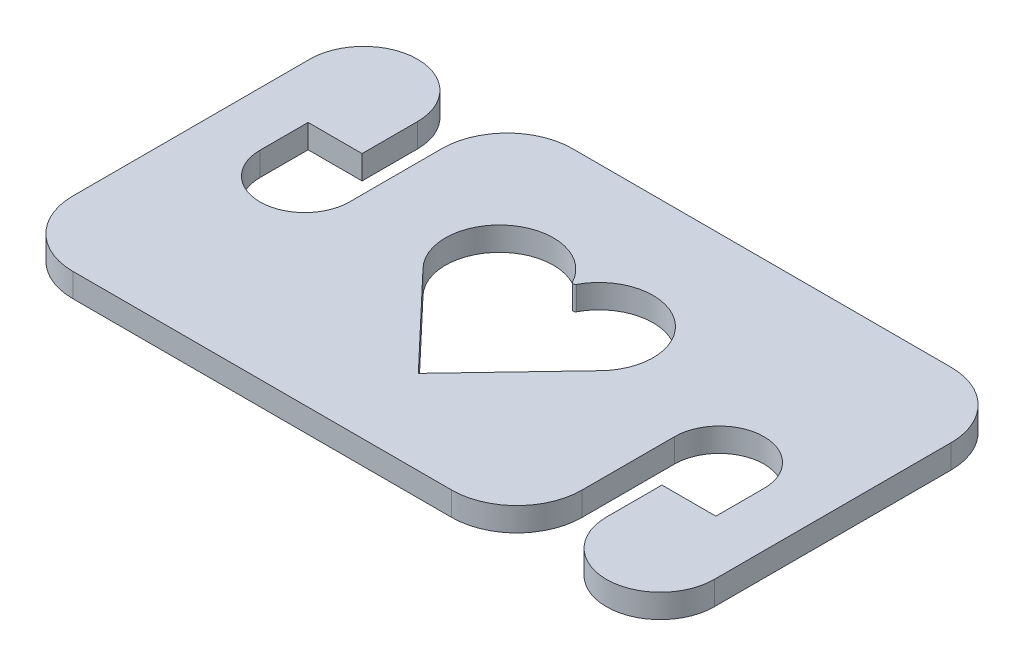
ISO-10303-21;
HEADER;
FILE_DESCRIPTION(('STEP AP214'),'2;1');
FILE_NAME('part.step','',(''),(''),'','','');
FILE_SCHEMA(('AUTOMOTIVE_DESIGN { 1 0 10303 214 1 1 1 1 }'));
ENDSEC;
DATA;
#1=APPLICATION_CONTEXT('core data for automotive mechanical design processes');
#2=APPLICATION_PROTOCOL_DEFINITION('international standard','automotive_design',2000,#1);
#3=PRODUCT_CONTEXT('',#1,'mechanical');
#4=PRODUCT('Part','Part','',(#3));
#5=PRODUCT_RELATED_PRODUCT_CATEGORY('part','',(#4));
#6=PRODUCT_DEFINITION_FORMATION('','',#4);
#7=PRODUCT_DEFINITION_CONTEXT('part definition',#1,'design');
#8=PRODUCT_DEFINITION('design','',#6,#7);
#9=PRODUCT_DEFINITION_SHAPE('','',#8);
#10=(LENGTH_UNIT() NAMED_UNIT(*) SI_UNIT(.MILLI.,.METRE.));
#11=(NAMED_UNIT(*) PLANE_ANGLE_UNIT() SI_UNIT($,.RADIAN.));
#12=(NAMED_UNIT(*) SI_UNIT($,.STERADIAN.) SOLID_ANGLE_UNIT());
#13=UNCERTAINTY_MEASURE_WITH_UNIT(LENGTH_MEASURE(1.E-05),#10,'distance_accuracy_value','');
#14=(GEOMETRIC_REPRESENTATION_CONTEXT(3) GLOBAL_UNCERTAINTY_ASSIGNED_CONTEXT((#13)) GLOBAL_UNIT_ASSIGNED_CONTEXT((#10,
#11,#12)) REPRESENTATION_CONTEXT('',''));
#15=CARTESIAN_POINT('',(0.,0.,0.));
#16=DIRECTION('',(0.,0.,1.));
#17=DIRECTION('',(1.,0.,0.));
#18=AXIS2_PLACEMENT_3D('',#15,#16,#17);
#19=CARTESIAN_POINT('',(8.31734508917886,2.,-11.7196730618924));
#20=DIRECTION('',(0.,-1.,0.));
#21=DIRECTION('',(0.,0.,-1.));
#22=AXIS2_PLACEMENT_3D('',#19,#20,#21);
#23=CYLINDRICAL_SURFACE('',#22,3.77244836305961);
#24=CARTESIAN_POINT('',(8.31734508917886,0.,-11.7196730618924));
#25=DIRECTION('',(0.,1.,0.));
#26=DIRECTION('',(0.,0.,1.));
#27=AXIS2_PLACEMENT_3D('',#24,#25,#26);
#28=CIRCLE('',#27,3.77244836305961);
#29=CARTESIAN_POINT('',(4.54489672611924,0.,-11.7196730618924));
#30=VERTEX_POINT('',#29);
#31=CARTESIAN_POINT('',(12.0897934522385,0.,-11.7196730618924));
#32=VERTEX_POINT('',#31);
#33=EDGE_CURVE('E250',#30,#32,#28,.T.);
#34=ORIENTED_EDGE('',*,*,#33,.F.);
#35=DIRECTION('',(0.,-1.,0.));
#36=VECTOR('',#35,1.);
#37=CARTESIAN_POINT('',(4.54489672611924,2.,-11.7196730618924));
#38=LINE('',#37,#36);
#39=CARTESIAN_POINT('',(4.54489672611924,2.,-11.7196730618924));
#40=VERTEX_POINT('',#39);
#41=EDGE_CURVE('E408',#40,#30,#38,.T.);
#42=ORIENTED_EDGE('',*,*,#41,.F.);
#43=CARTESIAN_POINT('',(8.31734508917886,2.,-11.7196730618924));
#44=DIRECTION('',(0.,1.,0.));
#45=DIRECTION('',(0.,0.,1.));
#46=AXIS2_PLACEMENT_3D('',#43,#44,#45);
#47=CIRCLE('',#46,3.77244836305961);
#48=CARTESIAN_POINT('',(12.0897934522385,2.,-11.7196730618924));
#49=VERTEX_POINT('',#48);
#50=EDGE_CURVE('E254',#40,#49,#47,.T.);
#51=ORIENTED_EDGE('',*,*,#50,.T.);
#52=DIRECTION('',(0.,-1.,0.));
#53=VECTOR('',#52,1.);
#54=CARTESIAN_POINT('',(12.0897934522385,2.,-11.7196730618924));
#55=LINE('',#54,#53);
#56=EDGE_CURVE('E333',#49,#32,#55,.T.);
#57=ORIENTED_EDGE('',*,*,#56,.T.);
#58=EDGE_LOOP('',(#34,#42,#51,#57));
#59=FACE_BOUND('',#58,.T.);
#60=ADVANCED_FACE('F39',(#59),#23,.F.);
#61=CARTESIAN_POINT('',(4.54489672611924,2.,-15.7765975248681));
#62=DIRECTION('',(1.,0.,0.));
#63=DIRECTION('',(0.,0.,-1.));
#64=AXIS2_PLACEMENT_3D('',#61,#62,#63);
#65=PLANE('',#64);
#66=DIRECTION('',(0.,0.,1.));
#67=VECTOR('',#66,1.);
#68=CARTESIAN_POINT('',(4.54489672611924,0.,-15.7765975248681));
#69=LINE('',#68,#67);
#70=CARTESIAN_POINT('',(4.54489672611924,0.,-15.7765975248681));
#71=VERTEX_POINT('',#70);
#72=EDGE_CURVE('E259',#71,#30,#69,.T.);
#73=ORIENTED_EDGE('',*,*,#72,.F.);
#74=DIRECTION('',(0.,-1.,0.));
#75=VECTOR('',#74,1.);
#76=CARTESIAN_POINT('',(4.54489672611924,2.,-15.7765975248681));
#77=LINE('',#76,#75);
#78=CARTESIAN_POINT('',(4.54489672611924,2.,-15.7765975248681));
#79=VERTEX_POINT('',#78);
#80=EDGE_CURVE('E412',#79,#71,#77,.T.);
#81=ORIENTED_EDGE('',*,*,#80,.F.);
#82=DIRECTION('',(0.,0.,1.));
#83=VECTOR('',#82,1.);
#84=CARTESIAN_POINT('',(4.54489672611924,2.,-15.7765975248681));
#85=LINE('',#84,#83);
#86=EDGE_CURVE('E329',#79,#40,#85,.T.);
#87=ORIENTED_EDGE('',*,*,#86,.T.);
#88=ORIENTED_EDGE('',*,*,#41,.T.);
#89=EDGE_LOOP('',(#73,#81,#87,#88));
#90=FACE_BOUND('',#89,.T.);
#91=ADVANCED_FACE('F497',(#90),#65,.T.);
#92=CARTESIAN_POINT('',(9.08979345223871,2.,-15.7765975248681));
#93=DIRECTION('',(0.,0.,1.));
#94=DIRECTION('',(1.,0.,0.));
#95=AXIS2_PLACEMENT_3D('',#92,#93,#94);
#96=PLANE('',#95);
#97=DIRECTION('',(-1.,0.,0.));
#98=VECTOR('',#97,1.);
#99=CARTESIAN_POINT('',(9.08979345223871,0.,-15.7765975248681));
#100=LINE('',#99,#98);
#101=CARTESIAN_POINT('',(9.08979345223871,0.,-15.7765975248681));
#102=VERTEX_POINT('',#101);
#103=EDGE_CURVE('E401',#102,#71,#100,.T.);
#104=ORIENTED_EDGE('',*,*,#103,.F.);
#105=DIRECTION('',(0.,-1.,0.));
#106=VECTOR('',#105,1.);
#107=CARTESIAN_POINT('',(9.08979345223871,2.,-15.7765975248681));
#108=LINE('',#107,#106);
#109=CARTESIAN_POINT('',(9.08979345223871,2.,-15.7765975248681));
#110=VERTEX_POINT('',#109);
#111=EDGE_CURVE('E415',#110,#102,#108,.T.);
#112=ORIENTED_EDGE('',*,*,#111,.F.);
#113=DIRECTION('',(-1.,0.,0.));
#114=VECTOR('',#113,1.);
#115=CARTESIAN_POINT('',(9.08979345223871,2.,-15.7765975248681));
#116=LINE('',#115,#114);
#117=EDGE_CURVE('E325',#110,#79,#116,.T.);
#118=ORIENTED_EDGE('',*,*,#117,.T.);
#119=ORIENTED_EDGE('',*,*,#80,.T.);
#120=EDGE_LOOP('',(#104,#112,#118,#119));
#121=FACE_BOUND('',#120,.T.);
#122=ADVANCED_FACE('F502',(#121),#96,.T.);
#123=CARTESIAN_POINT('',(9.08979345223871,2.,-20.4551033654565));
#124=DIRECTION('',(1.,0.,0.));
#125=DIRECTION('',(0.,0.,-1.));
#126=AXIS2_PLACEMENT_3D('',#123,#124,#125);
#127=PLANE('',#126);
#128=DIRECTION('',(0.,0.,1.));
#129=VECTOR('',#128,1.);
#130=CARTESIAN_POINT('',(9.08979345223871,0.,-20.4551033654565));
#131=LINE('',#130,#129);
#132=CARTESIAN_POINT('',(9.08979345223859,0.,-20.4551033654565));
#133=VERTEX_POINT('',#132);
#134=EDGE_CURVE('E397',#133,#102,#131,.T.);
#135=ORIENTED_EDGE('',*,*,#134,.F.);
#136=DIRECTION('',(0.,-1.,0.));
#137=VECTOR('',#136,1.);
#138=CARTESIAN_POINT('',(9.08979345223859,2.,-20.4551033654565));
#139=LINE('',#138,#137);
#140=CARTESIAN_POINT('',(9.08979345223859,2.,-20.4551033654565));
#141=VERTEX_POINT('',#140);
#142=EDGE_CURVE('E418',#141,#133,#139,.T.);
#143=ORIENTED_EDGE('',*,*,#142,.F.);
#144=DIRECTION('',(0.,0.,1.));
#145=VECTOR('',#144,1.);
#146=CARTESIAN_POINT('',(9.08979345223871,2.,-20.4551033654565));
#147=LINE('',#146,#145);
#148=EDGE_CURVE('E321',#141,#110,#147,.T.);
#149=ORIENTED_EDGE('',*,*,#148,.T.);
#150=ORIENTED_EDGE('',*,*,#111,.T.);
#151=EDGE_LOOP('',(#135,#143,#149,#150));
#152=FACE_BOUND('',#151,.T.);
#153=ADVANCED_FACE('F570',(#152),#127,.T.);
#154=CARTESIAN_POINT('',(4.54489672611924,2.,-20.4551033654566));
#155=DIRECTION('',(0.,-1.,0.));
#156=DIRECTION('',(0.,0.,-1.));
#157=AXIS2_PLACEMENT_3D('',#154,#155,#156);
#158=CYLINDRICAL_SURFACE('',#157,4.54489672611936);
#159=CARTESIAN_POINT('',(4.54489672611924,0.,-20.4551033654566));
#160=DIRECTION('',(0.,-1.,0.));
#161=DIRECTION('',(0.,0.,-1.));
#162=AXIS2_PLACEMENT_3D('',#159,#160,#161);
#163=CIRCLE('',#162,4.54489672611936);
#164=CARTESIAN_POINT('',(0.,0.,-20.4551032738808));
#165=VERTEX_POINT('',#164);
#166=EDGE_CURVE('E393',#165,#133,#163,.T.);
#167=ORIENTED_EDGE('',*,*,#166,.F.);
#168=DIRECTION('',(0.,-1.,0.));
#169=VECTOR('',#168,1.);
#170=CARTESIAN_POINT('',(0.,2.,-20.4551032738808));
#171=LINE('',#170,#169);
#172=CARTESIAN_POINT('',(0.,2.,-20.4551032738808));
#173=VERTEX_POINT('',#172);
#174=EDGE_CURVE('E421',#173,#165,#171,.T.);
#175=ORIENTED_EDGE('',*,*,#174,.F.);
#176=CARTESIAN_POINT('',(4.54489672611924,2.,-20.4551033654566));
#177=DIRECTION('',(0.,-1.,0.));
#178=DIRECTION('',(0.,0.,-1.));
#179=AXIS2_PLACEMENT_3D('',#176,#177,#178);
#180=CIRCLE('',#179,4.54489672611936);
#181=EDGE_CURVE('E317',#173,#141,#180,.T.);
#182=ORIENTED_EDGE('',*,*,#181,.T.);
#183=ORIENTED_EDGE('',*,*,#142,.T.);
#184=EDGE_LOOP('',(#167,#175,#182,#183));
#185=FACE_BOUND('',#184,.T.);
#186=ADVANCED_FACE('F566',(#185),#158,.T.);
#187=CARTESIAN_POINT('',(0.,2.,-0.500000091575878));
#188=DIRECTION('',(-1.,0.,0.));
#189=DIRECTION('',(0.,0.,1.));
#190=AXIS2_PLACEMENT_3D('',#187,#188,#189);
#191=PLANE('',#190);
#192=DIRECTION('',(0.,0.,-1.));
#193=VECTOR('',#192,1.);
#194=CARTESIAN_POINT('',(0.,0.,-0.500000091575878));
#195=LINE('',#194,#193);
#196=CARTESIAN_POINT('',(0.,0.,-0.500000091575879));
#197=VERTEX_POINT('',#196);
#198=EDGE_CURVE('E389',#197,#165,#195,.T.);
#199=ORIENTED_EDGE('',*,*,#198,.F.);
#200=DIRECTION('',(0.,-1.,0.));
#201=VECTOR('',#200,1.);
#202=CARTESIAN_POINT('',(0.,2.,-0.500000091575879));
#203=LINE('',#202,#201);
#204=CARTESIAN_POINT('',(0.,2.,-0.500000091575879));
#205=VERTEX_POINT('',#204);
#206=EDGE_CURVE('E424',#205,#197,#203,.T.);
#207=ORIENTED_EDGE('',*,*,#206,.F.);
#208=DIRECTION('',(0.,0.,-1.));
#209=VECTOR('',#208,1.);
#210=CARTESIAN_POINT('',(0.,2.,-0.500000091575878));
#211=LINE('',#210,#209);
#212=EDGE_CURVE('E313',#205,#173,#211,.T.);
#213=ORIENTED_EDGE('',*,*,#212,.T.);
#214=ORIENTED_EDGE('',*,*,#174,.T.);
#215=EDGE_LOOP('',(#199,#207,#213,#214));
#216=FACE_BOUND('',#215,.T.);
#217=ADVANCED_FACE('F562',(#216),#191,.T.);
#218=CARTESIAN_POINT('',(5.5,2.,-0.500000091575838));
#219=DIRECTION('',(0.,-1.,0.));
#220=DIRECTION('',(0.,0.,-1.));
#221=AXIS2_PLACEMENT_3D('',#218,#219,#220);
#222=CYLINDRICAL_SURFACE('',#221,5.5);
#223=CARTESIAN_POINT('',(5.5,0.,-0.500000091575838));
#224=DIRECTION('',(0.,1.,0.));
#225=DIRECTION('',(0.,0.,1.));
#226=AXIS2_PLACEMENT_3D('',#223,#224,#225);
#227=CIRCLE('',#226,5.5);
#228=CARTESIAN_POINT('',(5.50000000000004,0.,4.99999990842416));
#229=VERTEX_POINT('',#228);
#230=EDGE_CURVE('E386',#197,#229,#227,.T.);
#231=ORIENTED_EDGE('',*,*,#230,.T.);
#232=DIRECTION('',(0.,-1.,0.));
#233=VECTOR('',#232,1.);
#234=CARTESIAN_POINT('',(5.50000000000004,2.,4.99999990842416));
#235=LINE('',#234,#233);
#236=CARTESIAN_POINT('',(5.50000000000004,2.,4.99999990842416));
#237=VERTEX_POINT('',#236);
#238=EDGE_CURVE('E427',#237,#229,#235,.T.);
#239=ORIENTED_EDGE('',*,*,#238,.F.);
#240=CARTESIAN_POINT('',(5.5,2.,-0.500000091575838));
#241=DIRECTION('',(0.,1.,0.));
#242=DIRECTION('',(0.,0.,1.));
#243=AXIS2_PLACEMENT_3D('',#240,#241,#242);
#244=CIRCLE('',#243,5.5);
#245=EDGE_CURVE('E309',#205,#237,#244,.T.);
#246=ORIENTED_EDGE('',*,*,#245,.F.);
#247=ORIENTED_EDGE('',*,*,#206,.T.);
#248=EDGE_LOOP('',(#231,#239,#246,#247));
#249=FACE_BOUND('',#248,.T.);
#250=ADVANCED_FACE('F558',(#249),#222,.T.);
#251=CARTESIAN_POINT('',(5.50000000000004,2.,4.99999990842416));
#252=DIRECTION('',(0.,0.,-1.));
#253=DIRECTION('',(-1.,0.,0.));
#254=AXIS2_PLACEMENT_3D('',#251,#252,#253);
#255=PLANE('',#254);
#256=DIRECTION('',(1.,0.,0.));
#257=VECTOR('',#256,1.);
#258=CARTESIAN_POINT('',(5.50000000000004,0.,4.99999990842416));
#259=LINE('',#258,#257);
#260=CARTESIAN_POINT('',(37.4102065477749,0.,4.99999990842416));
#261=VERTEX_POINT('',#260);
#262=EDGE_CURVE('E383',#229,#261,#259,.T.);
#263=ORIENTED_EDGE('',*,*,#262,.T.);
#264=DIRECTION('',(0.,-1.,0.));
#265=VECTOR('',#264,1.);
#266=CARTESIAN_POINT('',(37.4102065477749,2.,4.99999990842416));
#267=LINE('',#266,#265);
#268=CARTESIAN_POINT('',(37.4102065477749,2.,4.99999990842416));
#269=VERTEX_POINT('',#268);
#270=EDGE_CURVE('E431',#269,#261,#267,.T.);
#271=ORIENTED_EDGE('',*,*,#270,.F.);
#272=DIRECTION('',(-1.,0.,0.));
#273=VECTOR('',#272,1.);
#274=CARTESIAN_POINT('',(37.4102065477749,2.,4.99999990842416));
#275=LINE('',#274,#273);
#276=EDGE_CURVE('E306',#269,#237,#275,.T.);
#277=ORIENTED_EDGE('',*,*,#276,.T.);
#278=ORIENTED_EDGE('',*,*,#238,.T.);
#279=EDGE_LOOP('',(#263,#271,#277,#278));
#280=FACE_BOUND('',#279,.T.);
#281=ADVANCED_FACE('F554',(#280),#255,.F.);
#282=CARTESIAN_POINT('',(37.4102065477749,2.,-0.500000091575838));
#283=DIRECTION('',(0.,-1.,0.));
#284=DIRECTION('',(0.,0.,-1.));
#285=AXIS2_PLACEMENT_3D('',#282,#283,#284);
#286=CYLINDRICAL_SURFACE('',#285,5.49999999999999);
#287=CARTESIAN_POINT('',(37.4102065477749,0.,-0.500000091575838));
#288=DIRECTION('',(0.,-1.,0.));
#289=DIRECTION('',(0.,0.,-1.));
#290=AXIS2_PLACEMENT_3D('',#287,#288,#289);
#291=CIRCLE('',#290,5.49999999999999);
#292=CARTESIAN_POINT('',(42.9102065477749,0.,-0.500000091575834));
#293=VERTEX_POINT('',#292);
#294=EDGE_CURVE('E379',#293,#261,#291,.T.);
#295=ORIENTED_EDGE('',*,*,#294,.F.);
#296=DIRECTION('',(0.,-1.,0.));
#297=VECTOR('',#296,1.);
#298=CARTESIAN_POINT('',(42.9102065477749,2.,-0.500000091575834));
#299=LINE('',#298,#297);
#300=CARTESIAN_POINT('',(42.9102065477749,2.,-0.500000091575834));
#301=VERTEX_POINT('',#300);
#302=EDGE_CURVE('E435',#301,#293,#299,.T.);
#303=ORIENTED_EDGE('',*,*,#302,.F.);
#304=CARTESIAN_POINT('',(37.4102065477749,2.,-0.500000091575838));
#305=DIRECTION('',(0.,-1.,0.));
#306=DIRECTION('',(0.,0.,-1.));
#307=AXIS2_PLACEMENT_3D('',#304,#305,#306);
#308=CIRCLE('',#307,5.49999999999999);
#309=EDGE_CURVE('E302',#301,#269,#308,.T.);
#310=ORIENTED_EDGE('',*,*,#309,.T.);
#311=ORIENTED_EDGE('',*,*,#270,.T.);
#312=EDGE_LOOP('',(#295,#303,#310,#311));
#313=FACE_BOUND('',#312,.T.);
#314=ADVANCED_FACE('F550',(#313),#286,.T.);
#315=CARTESIAN_POINT('',(42.9102065477749,2.,-8.28032712125925));
#316=DIRECTION('',(1.,0.,0.));
#317=DIRECTION('',(0.,0.,-1.));
#318=AXIS2_PLACEMENT_3D('',#315,#316,#317);
#319=PLANE('',#318);
#320=DIRECTION('',(0.,0.,1.));
#321=VECTOR('',#320,1.);
#322=CARTESIAN_POINT('',(42.9102065477749,0.,-8.28032712125925));
#323=LINE('',#322,#321);
#324=CARTESIAN_POINT('',(42.9102065477749,0.,-8.28032712125925));
#325=VERTEX_POINT('',#324);
#326=EDGE_CURVE('E375',#325,#293,#323,.T.);
#327=ORIENTED_EDGE('',*,*,#326,.F.);
#328=DIRECTION('',(0.,-1.,0.));
#329=VECTOR('',#328,1.);
#330=CARTESIAN_POINT('',(42.9102065477749,2.,-8.28032712125925));
#331=LINE('',#330,#329);
#332=CARTESIAN_POINT('',(42.9102065477749,2.,-8.28032712125925));
#333=VERTEX_POINT('',#332);
#334=EDGE_CURVE('E438',#333,#325,#331,.T.);
#335=ORIENTED_EDGE('',*,*,#334,.F.);
#336=DIRECTION('',(0.,0.,1.));
#337=VECTOR('',#336,1.);
#338=CARTESIAN_POINT('',(42.9102065477749,2.,-8.28032712125925));
#339=LINE('',#338,#337);
#340=EDGE_CURVE('E298',#333,#301,#339,.T.);
#341=ORIENTED_EDGE('',*,*,#340,.T.);
#342=ORIENTED_EDGE('',*,*,#302,.T.);
#343=EDGE_LOOP('',(#327,#335,#341,#342));
#344=FACE_BOUND('',#343,.T.);
#345=ADVANCED_FACE('F546',(#344),#319,.T.);
#346=CARTESIAN_POINT('',(46.6826549108346,2.,-8.28032712125925));
#347=DIRECTION('',(0.,-1.,0.));
#348=DIRECTION('',(0.,0.,-1.));
#349=AXIS2_PLACEMENT_3D('',#346,#347,#348);
#350=CYLINDRICAL_SURFACE('',#349,3.77244836305962);
#351=CARTESIAN_POINT('',(46.6826549108346,0.,-8.28032712125925));
#352=DIRECTION('',(0.,1.,0.));
#353=DIRECTION('',(0.,0.,1.));
#354=AXIS2_PLACEMENT_3D('',#351,#352,#353);
#355=CIRCLE('',#354,3.77244836305962);
#356=CARTESIAN_POINT('',(50.4551032738942,0.,-8.28032712125925));
#357=VERTEX_POINT('',#356);
#358=EDGE_CURVE('E371',#357,#325,#355,.T.);
#359=ORIENTED_EDGE('',*,*,#358,.F.);
#360=DIRECTION('',(0.,-1.,0.));
#361=VECTOR('',#360,1.);
#362=CARTESIAN_POINT('',(50.4551032738942,2.,-8.28032712125925));
#363=LINE('',#362,#361);
#364=CARTESIAN_POINT('',(50.4551032738942,2.,-8.28032712125925));
#365=VERTEX_POINT('',#364);
#366=EDGE_CURVE('E441',#365,#357,#363,.T.);
#367=ORIENTED_EDGE('',*,*,#366,.F.);
#368=CARTESIAN_POINT('',(46.6826549108346,2.,-8.28032712125925));
#369=DIRECTION('',(0.,1.,0.));
#370=DIRECTION('',(0.,0.,1.));
#371=AXIS2_PLACEMENT_3D('',#368,#369,#370);
#372=CIRCLE('',#371,3.77244836305962);
#373=EDGE_CURVE('E294',#365,#333,#372,.T.);
#374=ORIENTED_EDGE('',*,*,#373,.T.);
#375=ORIENTED_EDGE('',*,*,#334,.T.);
#376=EDGE_LOOP('',(#359,#367,#374,#375));
#377=FACE_BOUND('',#376,.T.);
#378=ADVANCED_FACE('F542',(#377),#350,.F.);
#379=CARTESIAN_POINT('',(50.4551032738942,2.,-4.22340265828359));
#380=DIRECTION('',(-1.,0.,0.));
#381=DIRECTION('',(0.,0.,1.));
#382=AXIS2_PLACEMENT_3D('',#379,#380,#381);
#383=PLANE('',#382);
#384=DIRECTION('',(0.,0.,-1.));
#385=VECTOR('',#384,1.);
#386=CARTESIAN_POINT('',(50.4551032738942,0.,-4.22340265828359));
#387=LINE('',#386,#385);
#388=CARTESIAN_POINT('',(50.4551032738942,0.,-4.22340265828359));
#389=VERTEX_POINT('',#388);
#390=EDGE_CURVE('E367',#389,#357,#387,.T.);
#391=ORIENTED_EDGE('',*,*,#390,.F.);
#392=DIRECTION('',(0.,-1.,0.));
#393=VECTOR('',#392,1.);
#394=CARTESIAN_POINT('',(50.4551032738942,2.,-4.22340265828359));
#395=LINE('',#394,#393);
#396=CARTESIAN_POINT('',(50.4551032738942,2.,-4.22340265828359));
#397=VERTEX_POINT('',#396);
#398=EDGE_CURVE('E444',#397,#389,#395,.T.);
#399=ORIENTED_EDGE('',*,*,#398,.F.);
#400=DIRECTION('',(0.,0.,-1.));
#401=VECTOR('',#400,1.);
#402=CARTESIAN_POINT('',(50.4551032738942,2.,-4.22340265828359));
#403=LINE('',#402,#401);
#404=EDGE_CURVE('E290',#397,#365,#403,.T.);
#405=ORIENTED_EDGE('',*,*,#404,.T.);
#406=ORIENTED_EDGE('',*,*,#366,.T.);
#407=EDGE_LOOP('',(#391,#399,#405,#406));
#408=FACE_BOUND('',#407,.T.);
#409=ADVANCED_FACE('F538',(#408),#383,.T.);
#410=CARTESIAN_POINT('',(45.9102065477749,2.,-4.22340265828359));
#411=DIRECTION('',(0.,0.,-1.));
#412=DIRECTION('',(-1.,0.,0.));
#413=AXIS2_PLACEMENT_3D('',#410,#411,#412);
#414=PLANE('',#413);
#415=DIRECTION('',(1.,0.,0.));
#416=VECTOR('',#415,1.);
#417=CARTESIAN_POINT('',(45.9102065477749,0.,-4.22340265828359));
#418=LINE('',#417,#416);
#419=CARTESIAN_POINT('',(45.9102065477749,0.,-4.22340265828359));
#420=VERTEX_POINT('',#419);
#421=EDGE_CURVE('E363',#420,#389,#418,.T.);
#422=ORIENTED_EDGE('',*,*,#421,.F.);
#423=DIRECTION('',(0.,-1.,0.));
#424=VECTOR('',#423,1.);
#425=CARTESIAN_POINT('',(45.9102065477749,2.,-4.22340265828359));
#426=LINE('',#425,#424);
#427=CARTESIAN_POINT('',(45.9102065477749,2.,-4.22340265828359));
#428=VERTEX_POINT('',#427);
#429=EDGE_CURVE('E447',#428,#420,#426,.T.);
#430=ORIENTED_EDGE('',*,*,#429,.F.);
#431=DIRECTION('',(1.,0.,0.));
#432=VECTOR('',#431,1.);
#433=CARTESIAN_POINT('',(45.9102065477749,2.,-4.22340265828359));
#434=LINE('',#433,#432);
#435=EDGE_CURVE('E286',#428,#397,#434,.T.);
#436=ORIENTED_EDGE('',*,*,#435,.T.);
#437=ORIENTED_EDGE('',*,*,#398,.T.);
#438=EDGE_LOOP('',(#422,#430,#436,#437));
#439=FACE_BOUND('',#438,.T.);
#440=ADVANCED_FACE('F534',(#439),#414,.T.);
#441=CARTESIAN_POINT('',(45.9102065477749,2.,0.455103182304815));
#442=DIRECTION('',(-1.,0.,0.));
#443=DIRECTION('',(0.,0.,1.));
#444=AXIS2_PLACEMENT_3D('',#441,#442,#443);
#445=PLANE('',#444);
#446=DIRECTION('',(0.,0.,-1.));
#447=VECTOR('',#446,1.);
#448=CARTESIAN_POINT('',(45.9102065477749,0.,0.455103182304815));
#449=LINE('',#448,#447);
#450=CARTESIAN_POINT('',(45.9102065477749,0.,0.455103182304819));
#451=VERTEX_POINT('',#450);
#452=EDGE_CURVE('E359',#451,#420,#449,.T.);
#453=ORIENTED_EDGE('',*,*,#452,.F.);
#454=DIRECTION('',(0.,-1.,0.));
#455=VECTOR('',#454,1.);
#456=CARTESIAN_POINT('',(45.9102065477749,2.,0.455103182304819));
#457=LINE('',#456,#455);
#458=CARTESIAN_POINT('',(45.9102065477749,2.,0.455103182304819));
#459=VERTEX_POINT('',#458);
#460=EDGE_CURVE('E450',#459,#451,#457,.T.);
#461=ORIENTED_EDGE('',*,*,#460,.F.);
#462=DIRECTION('',(0.,0.,-1.));
#463=VECTOR('',#462,1.);
#464=CARTESIAN_POINT('',(45.9102065477749,2.,0.455103182304815));
#465=LINE('',#464,#463);
#466=EDGE_CURVE('E282',#459,#428,#465,.T.);
#467=ORIENTED_EDGE('',*,*,#466,.T.);
#468=ORIENTED_EDGE('',*,*,#429,.T.);
#469=EDGE_LOOP('',(#453,#461,#467,#468));
#470=FACE_BOUND('',#469,.T.);
#471=ADVANCED_FACE('F530',(#470),#445,.T.);
#472=CARTESIAN_POINT('',(50.4551032738942,2.,0.455103182304923));
#473=DIRECTION('',(0.,-1.,0.));
#474=DIRECTION('',(0.,0.,-1.));
#475=AXIS2_PLACEMENT_3D('',#472,#473,#474);
#476=CYLINDRICAL_SURFACE('',#475,4.54489672611924);
#477=CARTESIAN_POINT('',(50.4551032738942,0.,0.455103182304923));
#478=DIRECTION('',(0.,-1.,0.));
#479=DIRECTION('',(0.,0.,-1.));
#480=AXIS2_PLACEMENT_3D('',#477,#478,#479);
#481=CIRCLE('',#480,4.54489672611924);
#482=CARTESIAN_POINT('',(55.0000000000134,0.,0.455103090729089));
#483=VERTEX_POINT('',#482);
#484=EDGE_CURVE('E355',#483,#451,#481,.T.);
#485=ORIENTED_EDGE('',*,*,#484,.F.);
#486=DIRECTION('',(0.,-1.,0.));
#487=VECTOR('',#486,1.);
#488=CARTESIAN_POINT('',(55.0000000000134,2.,0.455103090729089));
#489=LINE('',#488,#487);
#490=CARTESIAN_POINT('',(55.0000000000134,2.,0.455103090729089));
#491=VERTEX_POINT('',#490);
#492=EDGE_CURVE('E453',#491,#483,#489,.T.);
#493=ORIENTED_EDGE('',*,*,#492,.F.);
#494=CARTESIAN_POINT('',(50.4551032738942,2.,0.455103182304923));
#495=DIRECTION('',(0.,-1.,0.));
#496=DIRECTION('',(0.,0.,-1.));
#497=AXIS2_PLACEMENT_3D('',#494,#495,#496);
#498=CIRCLE('',#497,4.54489672611924);
#499=EDGE_CURVE('E278',#491,#459,#498,.T.);
#500=ORIENTED_EDGE('',*,*,#499,.T.);
#501=ORIENTED_EDGE('',*,*,#460,.T.);
#502=EDGE_LOOP('',(#485,#493,#500,#501));
#503=FACE_BOUND('',#502,.T.);
#504=ADVANCED_FACE('F526',(#503),#476,.T.);
#505=CARTESIAN_POINT('',(55.0000000000134,2.,-19.5000000915758));
#506=DIRECTION('',(1.,0.,0.));
#507=DIRECTION('',(0.,0.,-1.));
#508=AXIS2_PLACEMENT_3D('',#505,#506,#507);
#509=PLANE('',#508);
#510=DIRECTION('',(0.,0.,1.));
#511=VECTOR('',#510,1.);
#512=CARTESIAN_POINT('',(55.0000000000134,0.,-19.5000000915758));
#513=LINE('',#512,#511);
#514=CARTESIAN_POINT('',(55.0000000000134,0.,-19.5000000915758));
#515=VERTEX_POINT('',#514);
#516=EDGE_CURVE('E351',#515,#483,#513,.T.);
#517=ORIENTED_EDGE('',*,*,#516,.F.);
#518=DIRECTION('',(0.,-1.,0.));
#519=VECTOR('',#518,1.);
#520=CARTESIAN_POINT('',(55.0000000000134,2.,-19.5000000915758));
#521=LINE('',#520,#519);
#522=CARTESIAN_POINT('',(55.0000000000134,2.,-19.5000000915758));
#523=VERTEX_POINT('',#522);
#524=EDGE_CURVE('E456',#523,#515,#521,.T.);
#525=ORIENTED_EDGE('',*,*,#524,.F.);
#526=DIRECTION('',(0.,0.,1.));
#527=VECTOR('',#526,1.);
#528=CARTESIAN_POINT('',(55.0000000000134,2.,-19.5000000915758));
#529=LINE('',#528,#527);
#530=EDGE_CURVE('E274',#523,#491,#529,.T.);
#531=ORIENTED_EDGE('',*,*,#530,.T.);
#532=ORIENTED_EDGE('',*,*,#492,.T.);
#533=EDGE_LOOP('',(#517,#525,#531,#532));
#534=FACE_BOUND('',#533,.T.);
#535=ADVANCED_FACE('F522',(#534),#509,.T.);
#536=CARTESIAN_POINT('',(49.5000000000134,2.,-19.5000000915758));
#537=DIRECTION('',(0.,-1.,0.));
#538=DIRECTION('',(0.,0.,-1.));
#539=AXIS2_PLACEMENT_3D('',#536,#537,#538);
#540=CYLINDRICAL_SURFACE('',#539,5.5);
#541=CARTESIAN_POINT('',(49.5000000000134,0.,-19.5000000915758));
#542=DIRECTION('',(0.,1.,0.));
#543=DIRECTION('',(0.,0.,1.));
#544=AXIS2_PLACEMENT_3D('',#541,#542,#543);
#545=CIRCLE('',#544,5.5);
#546=CARTESIAN_POINT('',(49.5000000000134,0.,-25.0000000915758));
#547=VERTEX_POINT('',#546);
#548=EDGE_CURVE('E348',#515,#547,#545,.T.);
#549=ORIENTED_EDGE('',*,*,#548,.T.);
#550=DIRECTION('',(0.,-1.,0.));
#551=VECTOR('',#550,1.);
#552=CARTESIAN_POINT('',(49.5000000000134,2.,-25.0000000915758));
#553=LINE('',#552,#551);
#554=CARTESIAN_POINT('',(49.5000000000134,2.,-25.0000000915758));
#555=VERTEX_POINT('',#554);
#556=EDGE_CURVE('E459',#555,#547,#553,.T.);
#557=ORIENTED_EDGE('',*,*,#556,.F.);
#558=CARTESIAN_POINT('',(49.5000000000134,2.,-19.5000000915758));
#559=DIRECTION('',(0.,1.,0.));
#560=DIRECTION('',(0.,0.,1.));
#561=AXIS2_PLACEMENT_3D('',#558,#559,#560);
#562=CIRCLE('',#561,5.5);
#563=EDGE_CURVE('E270',#523,#555,#562,.T.);
#564=ORIENTED_EDGE('',*,*,#563,.F.);
#565=ORIENTED_EDGE('',*,*,#524,.T.);
#566=EDGE_LOOP('',(#549,#557,#564,#565));
#567=FACE_BOUND('',#566,.T.);
#568=ADVANCED_FACE('F518',(#567),#540,.T.);
#569=CARTESIAN_POINT('',(49.5000000000134,2.,-25.0000000915758));
#570=DIRECTION('',(0.,0.,1.));
#571=DIRECTION('',(1.,0.,0.));
#572=AXIS2_PLACEMENT_3D('',#569,#570,#571);
#573=PLANE('',#572);
#574=DIRECTION('',(-1.,0.,0.));
#575=VECTOR('',#574,1.);
#576=CARTESIAN_POINT('',(49.5000000000134,0.,-25.0000000915758));
#577=LINE('',#576,#575);
#578=CARTESIAN_POINT('',(17.5897934522385,0.,-25.0000000915758));
#579=VERTEX_POINT('',#578);
#580=EDGE_CURVE('E345',#547,#579,#577,.T.);
#581=ORIENTED_EDGE('',*,*,#580,.T.);
#582=DIRECTION('',(0.,-1.,0.));
#583=VECTOR('',#582,1.);
#584=CARTESIAN_POINT('',(17.5897934522385,2.,-25.0000000915758));
#585=LINE('',#584,#583);
#586=CARTESIAN_POINT('',(17.5897934522385,2.,-25.0000000915758));
#587=VERTEX_POINT('',#586);
#588=EDGE_CURVE('E463',#587,#579,#585,.T.);
#589=ORIENTED_EDGE('',*,*,#588,.F.);
#590=DIRECTION('',(1.,0.,0.));
#591=VECTOR('',#590,1.);
#592=CARTESIAN_POINT('',(17.5897934522385,2.,-25.0000000915758));
#593=LINE('',#592,#591);
#594=EDGE_CURVE('E267',#587,#555,#593,.T.);
#595=ORIENTED_EDGE('',*,*,#594,.T.);
#596=ORIENTED_EDGE('',*,*,#556,.T.);
#597=EDGE_LOOP('',(#581,#589,#595,#596));
#598=FACE_BOUND('',#597,.T.);
#599=ADVANCED_FACE('F514',(#598),#573,.F.);
#600=CARTESIAN_POINT('',(17.5897934522385,2.,-19.5000000915758));
#601=DIRECTION('',(0.,-1.,0.));
#602=DIRECTION('',(0.,0.,-1.));
#603=AXIS2_PLACEMENT_3D('',#600,#601,#602);
#604=CYLINDRICAL_SURFACE('',#603,5.5);
#605=CARTESIAN_POINT('',(17.5897934522385,0.,-19.5000000915758));
#606=DIRECTION('',(0.,-1.,0.));
#607=DIRECTION('',(0.,0.,-1.));
#608=AXIS2_PLACEMENT_3D('',#605,#606,#607);
#609=CIRCLE('',#608,5.5);
#610=CARTESIAN_POINT('',(12.0897934522385,0.,-19.5000000915758));
#611=VERTEX_POINT('',#610);
#612=EDGE_CURVE('E341',#611,#579,#609,.T.);
#613=ORIENTED_EDGE('',*,*,#612,.F.);
#614=DIRECTION('',(0.,-1.,0.));
#615=VECTOR('',#614,1.);
#616=CARTESIAN_POINT('',(12.0897934522385,2.,-19.5000000915758));
#617=LINE('',#616,#615);
#618=CARTESIAN_POINT('',(12.0897934522385,2.,-19.5000000915758));
#619=VERTEX_POINT('',#618);
#620=EDGE_CURVE('E467',#619,#611,#617,.T.);
#621=ORIENTED_EDGE('',*,*,#620,.F.);
#622=CARTESIAN_POINT('',(17.5897934522385,2.,-19.5000000915758));
#623=DIRECTION('',(0.,-1.,0.));
#624=DIRECTION('',(0.,0.,-1.));
#625=AXIS2_PLACEMENT_3D('',#622,#623,#624);
#626=CIRCLE('',#625,5.5);
#627=EDGE_CURVE('E263',#619,#587,#626,.T.);
#628=ORIENTED_EDGE('',*,*,#627,.T.);
#629=ORIENTED_EDGE('',*,*,#588,.T.);
#630=EDGE_LOOP('',(#613,#621,#628,#629));
#631=FACE_BOUND('',#630,.T.);
#632=ADVANCED_FACE('F510',(#631),#604,.T.);
#633=CARTESIAN_POINT('',(12.0897934522385,2.,-11.7196730618924));
#634=DIRECTION('',(-1.,0.,0.));
#635=DIRECTION('',(0.,0.,1.));
#636=AXIS2_PLACEMENT_3D('',#633,#634,#635);
#637=PLANE('',#636);
#638=DIRECTION('',(0.,0.,-1.));
#639=VECTOR('',#638,1.);
#640=CARTESIAN_POINT('',(12.0897934522385,0.,-11.7196730618924));
#641=LINE('',#640,#639);
#642=EDGE_CURVE('E337',#32,#611,#641,.T.);
#643=ORIENTED_EDGE('',*,*,#642,.F.);
#644=ORIENTED_EDGE('',*,*,#56,.F.);
#645=DIRECTION('',(0.,0.,-1.));
#646=VECTOR('',#645,1.);
#647=CARTESIAN_POINT('',(12.0897934522385,2.,-11.7196730618924));
#648=LINE('',#647,#646);
#649=EDGE_CURVE('E258',#49,#619,#648,.T.);
#650=ORIENTED_EDGE('',*,*,#649,.T.);
#651=ORIENTED_EDGE('',*,*,#620,.T.);
#652=EDGE_LOOP('',(#643,#644,#650,#651));
#653=FACE_BOUND('',#652,.T.);
#654=ADVANCED_FACE('F507',(#653),#637,.T.);
#655=CARTESIAN_POINT('',(8.31734508917886,2.,-11.7196730618924));
#656=DIRECTION('',(0.,1.,0.));
#657=DIRECTION('',(0.,0.,1.));
#658=AXIS2_PLACEMENT_3D('',#655,#656,#657);
#659=PLANE('',#658);
#660=CARTESIAN_POINT('',(23.3035151807443,2.,-13.1365329205261));
#661=DIRECTION('',(0.,1.,0.));
#662=DIRECTION('',(0.,0.,-1.));
#663=AXIS2_PLACEMENT_3D('',#660,#661,#662);
#664=CIRCLE('',#663,4.55395321867739);
#665=CARTESIAN_POINT('',(27.3234528348969,2.,-15.2762972006813));
#666=VERTEX_POINT('',#665);
#667=CARTESIAN_POINT('',(20.0019016765892,2.,-10.0000000915758));
#668=VERTEX_POINT('',#667);
#669=EDGE_CURVE('E233',#666,#668,#664,.T.);
#670=ORIENTED_EDGE('',*,*,#669,.F.);
#671=CARTESIAN_POINT('',(27.5000000000134,2.,-15.3702711251995));
#672=DIRECTION('',(0.,1.,0.));
#673=DIRECTION('',(0.,0.,1.));
#674=AXIS2_PLACEMENT_3D('',#671,#672,#673);
#675=CIRCLE('',#674,0.2);
#676=CARTESIAN_POINT('',(27.6765471651299,2.,-15.2762972006813));
#677=VERTEX_POINT('',#676);
#678=EDGE_CURVE('E62',#666,#677,#675,.T.);
#679=ORIENTED_EDGE('',*,*,#678,.T.);
#680=CARTESIAN_POINT('',(31.6964848192825,2.,-13.1365329205261));
#681=DIRECTION('',(0.,1.,0.));
#682=DIRECTION('',(0.,0.,1.));
#683=AXIS2_PLACEMENT_3D('',#680,#681,#682);
#684=CIRCLE('',#683,4.5539532186774);
#685=CARTESIAN_POINT('',(34.9980983234376,2.,-10.0000000915758));
#686=VERTEX_POINT('',#685);
#687=EDGE_CURVE('E242',#686,#677,#684,.T.);
#688=ORIENTED_EDGE('',*,*,#687,.F.);
#689=DIRECTION('',(0.688749461915023,0.,-0.7249994335941));
#690=VECTOR('',#689,1.);
#691=CARTESIAN_POINT('',(27.5000000000134,2.,-2.10726501429439));
#692=LINE('',#691,#690);
#693=CARTESIAN_POINT('',(27.5000000000134,2.,-2.10726501429439));
#694=VERTEX_POINT('',#693);
#695=EDGE_CURVE('E213',#694,#686,#692,.T.);
#696=ORIENTED_EDGE('',*,*,#695,.F.);
#697=DIRECTION('',(0.688749461915023,0.,0.724999433594101));
#698=VECTOR('',#697,1.);
#699=CARTESIAN_POINT('',(27.5000000000134,2.,-2.10726501429439));
#700=LINE('',#699,#698);
#701=EDGE_CURVE('E229',#668,#694,#700,.T.);
#702=ORIENTED_EDGE('',*,*,#701,.F.);
#703=EDGE_LOOP('',(#670,#679,#688,#696,#702));
#704=FACE_BOUND('',#703,.T.);
#705=ORIENTED_EDGE('',*,*,#50,.F.);
#706=ORIENTED_EDGE('',*,*,#86,.F.);
#707=ORIENTED_EDGE('',*,*,#117,.F.);
#708=ORIENTED_EDGE('',*,*,#148,.F.);
#709=ORIENTED_EDGE('',*,*,#181,.F.);
#710=ORIENTED_EDGE('',*,*,#212,.F.);
#711=ORIENTED_EDGE('',*,*,#245,.T.);
#712=ORIENTED_EDGE('',*,*,#276,.F.);
#713=ORIENTED_EDGE('',*,*,#309,.F.);
#714=ORIENTED_EDGE('',*,*,#340,.F.);
#715=ORIENTED_EDGE('',*,*,#373,.F.);
#716=ORIENTED_EDGE('',*,*,#404,.F.);
#717=ORIENTED_EDGE('',*,*,#435,.F.);
#718=ORIENTED_EDGE('',*,*,#466,.F.);
#719=ORIENTED_EDGE('',*,*,#499,.F.);
#720=ORIENTED_EDGE('',*,*,#530,.F.);
#721=ORIENTED_EDGE('',*,*,#563,.T.);
#722=ORIENTED_EDGE('',*,*,#594,.F.);
#723=ORIENTED_EDGE('',*,*,#627,.F.);
#724=ORIENTED_EDGE('',*,*,#649,.F.);
#725=EDGE_LOOP('',(#705,#706,#707,#708,#709,#710,#711,#712,#713,#714,#715,#716,#717,#718,#719,
#720,#721,#722,#723,#724));
#726=FACE_BOUND('',#725,.T.);
#727=ADVANCED_FACE('F484',(#704,#726),#659,.T.);
#728=CARTESIAN_POINT('',(8.31734508917886,0.,-11.7196730618924));
#729=DIRECTION('',(0.,1.,0.));
#730=DIRECTION('',(0.,0.,1.));
#731=AXIS2_PLACEMENT_3D('',#728,#729,#730);
#732=PLANE('',#731);
#733=CARTESIAN_POINT('',(31.6964848192825,0.,-13.1365329205261));
#734=DIRECTION('',(0.,1.,0.));
#735=DIRECTION('',(0.,0.,1.));
#736=AXIS2_PLACEMENT_3D('',#733,#734,#735);
#737=CIRCLE('',#736,4.5539532186774);
#738=CARTESIAN_POINT('',(34.9980983234376,0.,-10.0000000915758));
#739=VERTEX_POINT('',#738);
#740=CARTESIAN_POINT('',(27.6765471651299,0.,-15.2762972006813));
#741=VERTEX_POINT('',#740);
#742=EDGE_CURVE('E218',#739,#741,#737,.T.);
#743=ORIENTED_EDGE('',*,*,#742,.T.);
#744=CARTESIAN_POINT('',(27.5000000000134,0.,-15.3702711251995));
#745=DIRECTION('',(0.,1.,0.));
#746=DIRECTION('',(0.,0.,1.));
#747=AXIS2_PLACEMENT_3D('',#744,#745,#746);
#748=CIRCLE('',#747,0.2);
#749=CARTESIAN_POINT('',(27.3234528348969,0.,-15.2762972006813));
#750=VERTEX_POINT('',#749);
#751=EDGE_CURVE('E11',#741,#750,#748,.F.);
#752=ORIENTED_EDGE('',*,*,#751,.T.);
#753=CARTESIAN_POINT('',(23.3035151807443,0.,-13.1365329205261));
#754=DIRECTION('',(0.,1.,0.));
#755=DIRECTION('',(0.,0.,-1.));
#756=AXIS2_PLACEMENT_3D('',#753,#754,#755);
#757=CIRCLE('',#756,4.55395321867739);
#758=CARTESIAN_POINT('',(20.0019016765892,0.,-10.0000000915758));
#759=VERTEX_POINT('',#758);
#760=EDGE_CURVE('E223',#750,#759,#757,.T.);
#761=ORIENTED_EDGE('',*,*,#760,.T.);
#762=DIRECTION('',(0.688749461915023,0.,0.724999433594101));
#763=VECTOR('',#762,1.);
#764=CARTESIAN_POINT('',(27.5000000000134,0.,-2.10726501429439));
#765=LINE('',#764,#763);
#766=CARTESIAN_POINT('',(27.5000000000134,0.,-2.10726501429439));
#767=VERTEX_POINT('',#766);
#768=EDGE_CURVE('E216',#759,#767,#765,.T.);
#769=ORIENTED_EDGE('',*,*,#768,.T.);
#770=DIRECTION('',(0.688749461915023,0.,-0.7249994335941));
#771=VECTOR('',#770,1.);
#772=CARTESIAN_POINT('',(27.5000000000134,0.,-2.10726501429439));
#773=LINE('',#772,#771);
#774=EDGE_CURVE('E210',#767,#739,#773,.T.);
#775=ORIENTED_EDGE('',*,*,#774,.T.);
#776=EDGE_LOOP('',(#743,#752,#761,#769,#775));
#777=FACE_BOUND('',#776,.T.);
#778=ORIENTED_EDGE('',*,*,#33,.T.);
#779=ORIENTED_EDGE('',*,*,#642,.T.);
#780=ORIENTED_EDGE('',*,*,#612,.T.);
#781=ORIENTED_EDGE('',*,*,#580,.F.);
#782=ORIENTED_EDGE('',*,*,#548,.F.);
#783=ORIENTED_EDGE('',*,*,#516,.T.);
#784=ORIENTED_EDGE('',*,*,#484,.T.);
#785=ORIENTED_EDGE('',*,*,#452,.T.);
#786=ORIENTED_EDGE('',*,*,#421,.T.);
#787=ORIENTED_EDGE('',*,*,#390,.T.);
#788=ORIENTED_EDGE('',*,*,#358,.T.);
#789=ORIENTED_EDGE('',*,*,#326,.T.);
#790=ORIENTED_EDGE('',*,*,#294,.T.);
#791=ORIENTED_EDGE('',*,*,#262,.F.);
#792=ORIENTED_EDGE('',*,*,#230,.F.);
#793=ORIENTED_EDGE('',*,*,#198,.T.);
#794=ORIENTED_EDGE('',*,*,#166,.T.);
#795=ORIENTED_EDGE('',*,*,#134,.T.);
#796=ORIENTED_EDGE('',*,*,#103,.T.);
#797=ORIENTED_EDGE('',*,*,#72,.T.);
#798=EDGE_LOOP('',(#778,#779,#780,#781,#782,#783,#784,#785,#786,#787,#788,#789,#790,#791,#792,
#793,#794,#795,#796,#797));
#799=FACE_BOUND('',#798,.T.);
#800=ADVANCED_FACE('F225',(#777,#799),#732,.F.);
#801=CARTESIAN_POINT('',(27.5000000000134,0.,-2.10726501429439));
#802=DIRECTION('',(0.7249994335941,0.,0.688749461915023));
#803=DIRECTION('',(0.688749461915023,0.,-0.7249994335941));
#804=AXIS2_PLACEMENT_3D('',#801,#802,#803);
#805=PLANE('',#804);
#806=ORIENTED_EDGE('',*,*,#695,.T.);
#807=DIRECTION('',(0.,1.,0.));
#808=VECTOR('',#807,1.);
#809=CARTESIAN_POINT('',(34.9980983234376,0.,-10.0000000915758));
#810=LINE('',#809,#808);
#811=EDGE_CURVE('E207',#739,#686,#810,.T.);
#812=ORIENTED_EDGE('',*,*,#811,.F.);
#813=ORIENTED_EDGE('',*,*,#774,.F.);
#814=DIRECTION('',(0.,1.,0.));
#815=VECTOR('',#814,1.);
#816=CARTESIAN_POINT('',(27.5000000000134,0.,-2.10726501429439));
#817=LINE('',#816,#815);
#818=EDGE_CURVE('E247',#767,#694,#817,.T.);
#819=ORIENTED_EDGE('',*,*,#818,.T.);
#820=EDGE_LOOP('',(#806,#812,#813,#819));
#821=FACE_BOUND('',#820,.T.);
#822=ADVANCED_FACE('F208',(#821),#805,.F.);
#823=CARTESIAN_POINT('',(27.5000000000134,0.,-2.10726501429439));
#824=DIRECTION('',(-0.724999433594101,0.,0.688749461915023));
#825=DIRECTION('',(0.688749461915023,0.,0.724999433594101));
#826=AXIS2_PLACEMENT_3D('',#823,#824,#825);
#827=PLANE('',#826);
#828=ORIENTED_EDGE('',*,*,#701,.T.);
#829=ORIENTED_EDGE('',*,*,#818,.F.);
#830=ORIENTED_EDGE('',*,*,#768,.F.);
#831=DIRECTION('',(0.,1.,0.));
#832=VECTOR('',#831,1.);
#833=CARTESIAN_POINT('',(20.0019016765892,0.,-10.0000000915758));
#834=LINE('',#833,#832);
#835=EDGE_CURVE('E215',#759,#668,#834,.T.);
#836=ORIENTED_EDGE('',*,*,#835,.T.);
#837=EDGE_LOOP('',(#828,#829,#830,#836));
#838=FACE_BOUND('',#837,.T.);
#839=ADVANCED_FACE('F487',(#838),#827,.F.);
#840=CARTESIAN_POINT('',(23.3035151807443,0.,-13.1365329205261));
#841=DIRECTION('',(0.,1.,0.));
#842=DIRECTION('',(0.,0.,1.));
#843=AXIS2_PLACEMENT_3D('',#840,#841,#842);
#844=CYLINDRICAL_SURFACE('',#843,4.55395321867739);
#845=ORIENTED_EDGE('',*,*,#760,.F.);
#846=DIRECTION('',(0.,1.,0.));
#847=VECTOR('',#846,1.);
#848=CARTESIAN_POINT('',(27.3234528348969,0.,-15.2762972006813));
#849=LINE('',#848,#847);
#850=EDGE_CURVE('E411',#750,#666,#849,.T.);
#851=ORIENTED_EDGE('',*,*,#850,.T.);
#852=ORIENTED_EDGE('',*,*,#669,.T.);
#853=ORIENTED_EDGE('',*,*,#835,.F.);
#854=EDGE_LOOP('',(#845,#851,#852,#853));
#855=FACE_BOUND('',#854,.T.);
#856=ADVANCED_FACE('F480',(#855),#844,.F.);
#857=CARTESIAN_POINT('',(31.6964848192825,0.,-13.1365329205261));
#858=DIRECTION('',(0.,1.,0.));
#859=DIRECTION('',(0.,0.,1.));
#860=AXIS2_PLACEMENT_3D('',#857,#858,#859);
#861=CYLINDRICAL_SURFACE('',#860,4.5539532186774);
#862=ORIENTED_EDGE('',*,*,#687,.T.);
#863=DIRECTION('',(0.,1.,0.));
#864=VECTOR('',#863,1.);
#865=CARTESIAN_POINT('',(27.6765471651299,0.,-15.2762972006813));
#866=LINE('',#865,#864);
#867=EDGE_CURVE('E48',#677,#741,#866,.F.);
#868=ORIENTED_EDGE('',*,*,#867,.T.);
#869=ORIENTED_EDGE('',*,*,#742,.F.);
#870=ORIENTED_EDGE('',*,*,#811,.T.);
#871=EDGE_LOOP('',(#862,#868,#869,#870));
#872=FACE_BOUND('',#871,.T.);
#873=ADVANCED_FACE('F219',(#872),#861,.F.);
#874=CARTESIAN_POINT('',(27.5000000000134,0.,-15.3702711251995));
#875=DIRECTION('',(0.,1.,0.));
#876=DIRECTION('',(0.,0.,1.));
#877=AXIS2_PLACEMENT_3D('',#874,#875,#876);
#878=CYLINDRICAL_SURFACE('',#877,0.2);
#879=ORIENTED_EDGE('',*,*,#751,.F.);
#880=ORIENTED_EDGE('',*,*,#867,.F.);
#881=ORIENTED_EDGE('',*,*,#678,.F.);
#882=ORIENTED_EDGE('',*,*,#850,.F.);
#883=EDGE_LOOP('',(#879,#880,#881,#882));
#884=FACE_BOUND('',#883,.T.);
#885=ADVANCED_FACE('F41',(#884),#878,.T.);
#886=CLOSED_SHELL('',(#60,#91,#122,#153,#186,#217,#250,#281,#314,#345,#378,#409,#440,#471,#504,
#535,#568,#599,#632,#654,#727,#800,#822,#839,#856,#873,#885));
#887=MANIFOLD_SOLID_BREP('B2',#886);
#888=ADVANCED_BREP_SHAPE_REPRESENTATION('',(#18,#887),#14);
#889=SHAPE_DEFINITION_REPRESENTATION(#9,#888);
ENDSEC;
END-ISO-10303-21;
